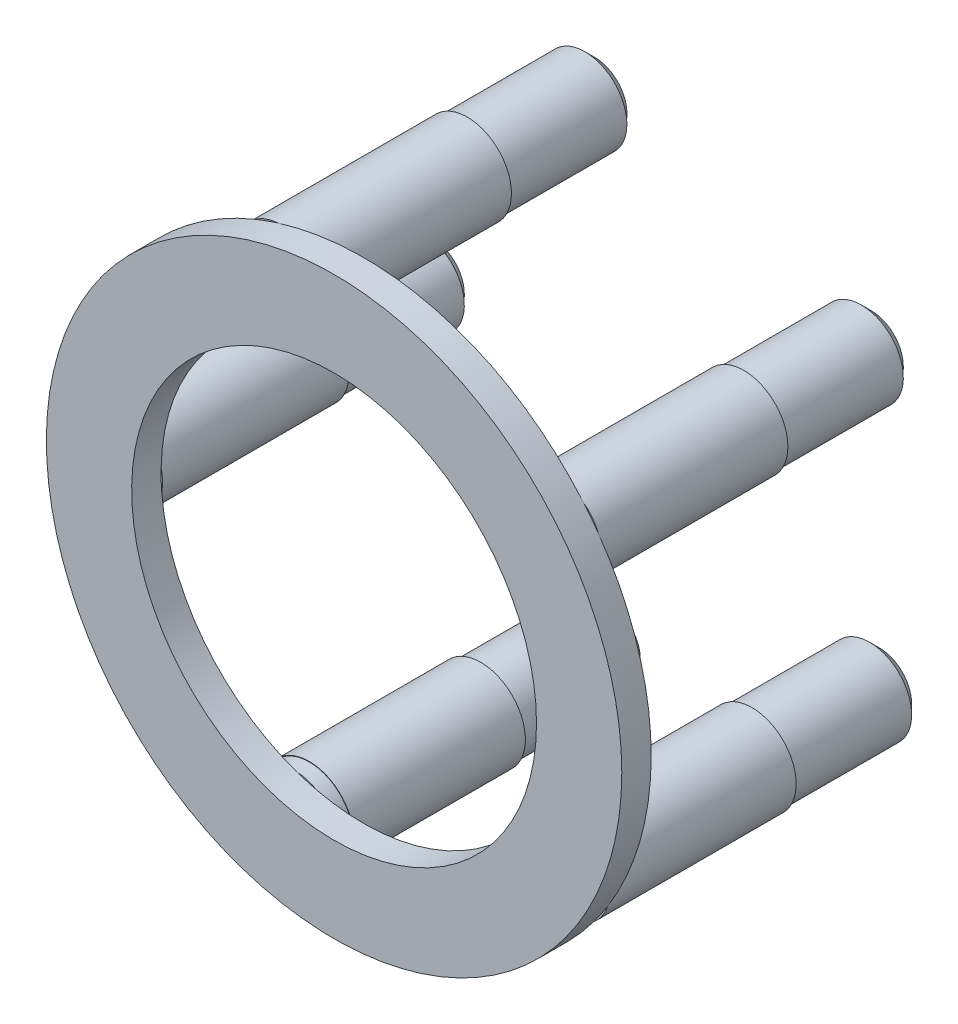
ISO-10303-21;
HEADER;
FILE_DESCRIPTION(('STEP AP214'),'2;1');
FILE_NAME('part.step','',(''),(''),'','','');
FILE_SCHEMA(('AUTOMOTIVE_DESIGN { 1 0 10303 214 1 1 1 1 }'));
ENDSEC;
DATA;
#1=APPLICATION_CONTEXT('core data for automotive mechanical design processes');
#2=APPLICATION_PROTOCOL_DEFINITION('international standard','automotive_design',2000,#1);
#3=PRODUCT_CONTEXT('',#1,'mechanical');
#4=PRODUCT('Part','Part','',(#3));
#5=PRODUCT_RELATED_PRODUCT_CATEGORY('part','',(#4));
#6=PRODUCT_DEFINITION_FORMATION('','',#4);
#7=PRODUCT_DEFINITION_CONTEXT('part definition',#1,'design');
#8=PRODUCT_DEFINITION('design','',#6,#7);
#9=PRODUCT_DEFINITION_SHAPE('','',#8);
#10=(LENGTH_UNIT() NAMED_UNIT(*) SI_UNIT(.MILLI.,.METRE.));
#11=(NAMED_UNIT(*) PLANE_ANGLE_UNIT() SI_UNIT($,.RADIAN.));
#12=(NAMED_UNIT(*) SI_UNIT($,.STERADIAN.) SOLID_ANGLE_UNIT());
#13=UNCERTAINTY_MEASURE_WITH_UNIT(LENGTH_MEASURE(1.E-05),#10,'distance_accuracy_value','');
#14=(GEOMETRIC_REPRESENTATION_CONTEXT(3) GLOBAL_UNCERTAINTY_ASSIGNED_CONTEXT((#13)) GLOBAL_UNIT_ASSIGNED_CONTEXT((#10,
#11,#12)) REPRESENTATION_CONTEXT('',''));
#15=CARTESIAN_POINT('',(0.,0.,0.));
#16=DIRECTION('',(0.,0.,1.));
#17=DIRECTION('',(1.,0.,0.));
#18=AXIS2_PLACEMENT_3D('',#15,#16,#17);
#19=CARTESIAN_POINT('',(20.1421615834205,-37.1244080791547,-6.01363198067618));
#20=DIRECTION('',(0.,0.,1.));
#21=DIRECTION('',(1.,0.,0.));
#22=AXIS2_PLACEMENT_3D('',#19,#20,#21);
#23=PLANE('',#22);
#24=CARTESIAN_POINT('',(39.9356979527047,-21.8529995652863,-6.01363198067618));
#25=DIRECTION('',(0.,0.,-1.));
#26=DIRECTION('',(-1.,0.,0.));
#27=AXIS2_PLACEMENT_3D('',#24,#25,#26);
#28=CIRCLE('',#27,4.5);
#29=CARTESIAN_POINT('',(35.8311516776716,-23.6976404181658,-6.01363198067618));
#30=VERTEX_POINT('',#29);
#31=CARTESIAN_POINT('',(42.5963362648425,-18.2238118087787,-6.01363198067618));
#32=VERTEX_POINT('',#31);
#33=EDGE_CURVE('E145',#30,#32,#28,.T.);
#34=ORIENTED_EDGE('',*,*,#33,.F.);
#35=CARTESIAN_POINT('',(20.1421615834205,-37.1244080791547,-6.01363198067618));
#36=DIRECTION('',(0.,0.,1.));
#37=DIRECTION('',(1.,0.,0.));
#38=AXIS2_PLACEMENT_3D('',#35,#36,#37);
#39=CIRCLE('',#38,20.6499999999925);
#40=CARTESIAN_POINT('',(14.1923892038894,-17.3501139417788,-6.01363198067618));
#41=VERTEX_POINT('',#40);
#42=EDGE_CURVE('E134',#30,#41,#39,.T.);
#43=ORIENTED_EDGE('',*,*,#42,.T.);
#44=CARTESIAN_POINT('',(11.7347281201779,-13.5805115757978,-6.01363198067618));
#45=DIRECTION('',(0.,0.,-1.));
#46=DIRECTION('',(-1.,0.,0.));
#47=AXIS2_PLACEMENT_3D('',#44,#45,#46);
#48=CIRCLE('',#47,4.5);
#49=CARTESIAN_POINT('',(11.4561788739959,-9.08914092560071,-6.01363198067618));
#50=VERTEX_POINT('',#49);
#51=EDGE_CURVE('E224',#50,#41,#48,.T.);
#52=ORIENTED_EDGE('',*,*,#51,.F.);
#53=CARTESIAN_POINT('',(20.1421615834205,-37.1244080791547,-6.01363198067618));
#54=DIRECTION('',(0.,0.,1.));
#55=DIRECTION('',(1.,0.,0.));
#56=AXIS2_PLACEMENT_3D('',#53,#54,#55);
#57=CIRCLE('',#56,29.3499999999926);
#58=EDGE_CURVE('E71',#32,#50,#57,.T.);
#59=ORIENTED_EDGE('',*,*,#58,.F.);
#60=EDGE_LOOP('',(#34,#43,#52,#59));
#61=FACE_BOUND('',#60,.T.);
#62=ADVANCED_FACE('F53',(#61),#23,.F.);
#63=CARTESIAN_POINT('',(40.7826732804343,-51.2300550648684,-6.01363198067618));
#64=DIRECTION('',(0.,0.,-1.));
#65=DIRECTION('',(-1.,0.,0.));
#66=AXIS2_PLACEMENT_3D('',#63,#64,#65);
#67=CIRCLE('',#66,4.5);
#68=CARTESIAN_POINT('',(43.6479857850963,-54.6999231100003,-6.01363198067618));
#69=VERTEX_POINT('',#68);
#70=CARTESIAN_POINT('',(36.5786670195808,-49.6249596288569,-6.01363198067618));
#71=VERTEX_POINT('',#70);
#72=EDGE_CURVE('E174',#69,#71,#67,.T.);
#73=ORIENTED_EDGE('',*,*,#72,.F.);
#74=CARTESIAN_POINT('',(13.0858444188183,-65.6135443958651,-6.01363198067618));
#75=VERTEX_POINT('',#74);
#76=EDGE_CURVE('E326',#75,#69,#57,.T.);
#77=ORIENTED_EDGE('',*,*,#76,.F.);
#78=CARTESIAN_POINT('',(13.1051629880769,-61.1135858635138,-6.01363198067618));
#79=DIRECTION('',(0.,0.,-1.));
#80=DIRECTION('',(-1.,0.,0.));
#81=AXIS2_PLACEMENT_3D('',#78,#79,#80);
#82=CIRCLE('',#81,4.5);
#83=CARTESIAN_POINT('',(15.3415579896269,-57.2086482971701,-6.01363198067618));
#84=VERTEX_POINT('',#83);
#85=EDGE_CURVE('E190',#84,#75,#82,.T.);
#86=ORIENTED_EDGE('',*,*,#85,.F.);
#87=EDGE_CURVE('E381',#84,#71,#39,.T.);
#88=ORIENTED_EDGE('',*,*,#87,.T.);
#89=EDGE_LOOP('',(#73,#77,#86,#88));
#90=FACE_BOUND('',#89,.T.);
#91=ADVANCED_FACE('F277',(#90),#23,.F.);
#92=CARTESIAN_POINT('',(10.6905526311843,-64.9109081864654,-6.01363198067618));
#93=VERTEX_POINT('',#92);
#94=CARTESIAN_POINT('',(13.3325900827298,-56.6193365472633,-6.01363198067618));
#95=VERTEX_POINT('',#94);
#96=EDGE_CURVE('E184',#93,#95,#82,.T.);
#97=ORIENTED_EDGE('',*,*,#96,.F.);
#98=CARTESIAN_POINT('',(-9.13313907577066,-39.2170789356275,-6.01363198067618));
#99=VERTEX_POINT('',#98);
#100=EDGE_CURVE('E311',#99,#93,#57,.T.);
#101=ORIENTED_EDGE('',*,*,#100,.F.);
#102=CARTESIAN_POINT('',(-4.84745442430447,-37.8448883263508,-6.01363198067618));
#103=DIRECTION('',(0.,0.,-1.));
#104=DIRECTION('',(-1.,0.,0.));
#105=AXIS2_PLACEMENT_3D('',#102,#103,#104);
#106=CIRCLE('',#105,4.5);
#107=CARTESIAN_POINT('',(-0.442554044497611,-38.7651342956315,-6.01363198067618));
#108=VERTEX_POINT('',#107);
#109=EDGE_CURVE('E341',#108,#99,#106,.T.);
#110=ORIENTED_EDGE('',*,*,#109,.F.);
#111=EDGE_CURVE('E313',#108,#95,#39,.T.);
#112=ORIENTED_EDGE('',*,*,#111,.T.);
#113=EDGE_LOOP('',(#97,#101,#110,#112));
#114=FACE_BOUND('',#113,.T.);
#115=ADVANCED_FACE('F282',(#114),#23,.F.);
#116=CARTESIAN_POINT('',(44.1211688258314,-20.2001736306495,-6.01363198067618));
#117=VERTEX_POINT('',#116);
#118=CARTESIAN_POINT('',(37.1100520999763,-25.3552453469181,-6.01363198067618));
#119=VERTEX_POINT('',#118);
#120=EDGE_CURVE('E79',#117,#119,#28,.T.);
#121=ORIENTED_EDGE('',*,*,#120,.F.);
#122=CARTESIAN_POINT('',(45.0564183994682,-52.6389917765534,-6.01363198067618));
#123=VERTEX_POINT('',#122);
#124=EDGE_CURVE('E397',#123,#117,#57,.T.);
#125=ORIENTED_EDGE('',*,*,#124,.F.);
#126=CARTESIAN_POINT('',(37.7599410238692,-47.896424955645,-6.01363198067618));
#127=VERTEX_POINT('',#126);
#128=EDGE_CURVE('E180',#127,#123,#67,.T.);
#129=ORIENTED_EDGE('',*,*,#128,.F.);
#130=EDGE_CURVE('E159',#127,#119,#39,.T.);
#131=ORIENTED_EDGE('',*,*,#130,.T.);
#132=EDGE_LOOP('',(#121,#125,#129,#131));
#133=FACE_BOUND('',#132,.T.);
#134=ADVANCED_FACE('F290',(#133),#23,.F.);
#135=CARTESIAN_POINT('',(11.7347281201779,-13.5805115757978,-6.01363198067618));
#136=DIRECTION('',(0.,0.,-1.));
#137=DIRECTION('',(-1.,0.,0.));
#138=AXIS2_PLACEMENT_3D('',#135,#136,#137);
#139=PLANE('',#138);
#140=CARTESIAN_POINT('',(12.2207112703518,-18.0541924291608,-6.01363198067618));
#141=VERTEX_POINT('',#140);
#142=EDGE_CURVE('E406',#41,#141,#48,.T.);
#143=ORIENTED_EDGE('',*,*,#142,.F.);
#144=EDGE_CURVE('E139',#41,#141,#39,.T.);
#145=ORIENTED_EDGE('',*,*,#144,.T.);
#146=EDGE_LOOP('',(#143,#145));
#147=FACE_BOUND('',#146,.T.);
#148=ADVANCED_FACE('F298',(#147),#139,.F.);
#149=CARTESIAN_POINT('',(11.7347281201779,-13.5805115757978,-59.7415540420351));
#150=DIRECTION('',(0.,0.,1.));
#151=DIRECTION('',(1.,0.,0.));
#152=AXIS2_PLACEMENT_3D('',#149,#150,#151);
#153=CYLINDRICAL_SURFACE('',#152,4.5);
#154=CARTESIAN_POINT('',(11.7347281201775,-13.5805115757804,-25.0136319806762));
#155=DIRECTION('',(0.,0.,1.));
#156=DIRECTION('',(1.,0.,0.));
#157=AXIS2_PLACEMENT_3D('',#154,#155,#156);
#158=CIRCLE('',#157,4.49999999999627);
#159=CARTESIAN_POINT('',(16.2347281201738,-13.5805115757804,-25.0136319806762));
#160=VERTEX_POINT('',#159);
#161=EDGE_CURVE('E526',#160,#160,#158,.F.);
#162=ORIENTED_EDGE('',*,*,#161,.F.);
#163=EDGE_LOOP('',(#162));
#164=FACE_BOUND('',#163,.T.);
#165=CARTESIAN_POINT('',(9.10534790982675,-9.92861347899748,-6.01363198067618));
#166=VERTEX_POINT('',#165);
#167=EDGE_CURVE('E219',#166,#50,#48,.T.);
#168=ORIENTED_EDGE('',*,*,#167,.T.);
#169=ORIENTED_EDGE('',*,*,#51,.T.);
#170=ORIENTED_EDGE('',*,*,#142,.T.);
#171=EDGE_CURVE('E213',#141,#166,#48,.T.);
#172=ORIENTED_EDGE('',*,*,#171,.T.);
#173=EDGE_LOOP('',(#168,#169,#170,#172));
#174=FACE_BOUND('',#173,.T.);
#175=ADVANCED_FACE('F302',(#164,#174),#153,.T.);
#176=EDGE_CURVE('E214',#50,#166,#57,.T.);
#177=ORIENTED_EDGE('',*,*,#176,.F.);
#178=ORIENTED_EDGE('',*,*,#167,.F.);
#179=EDGE_LOOP('',(#177,#178));
#180=FACE_BOUND('',#179,.T.);
#181=ADVANCED_FACE('F295',(#180),#139,.F.);
#182=CARTESIAN_POINT('',(20.1421615834205,-37.1244080791547,-3.01363198067618));
#183=DIRECTION('',(0.,0.,1.));
#184=DIRECTION('',(1.,0.,0.));
#185=AXIS2_PLACEMENT_3D('',#182,#183,#184);
#186=PLANE('',#185);
#187=CARTESIAN_POINT('',(20.1421615834205,-37.1244080791547,-3.01363198067618));
#188=DIRECTION('',(0.,0.,1.));
#189=DIRECTION('',(1.,0.,0.));
#190=AXIS2_PLACEMENT_3D('',#187,#188,#189);
#191=CIRCLE('',#190,29.3499999999926);
#192=CARTESIAN_POINT('',(49.4921615834131,-37.1244080791547,-3.01363198067618));
#193=VERTEX_POINT('',#192);
#194=EDGE_CURVE('E209',#193,#193,#191,.T.);
#195=ORIENTED_EDGE('',*,*,#194,.T.);
#196=EDGE_LOOP('',(#195));
#197=FACE_BOUND('',#196,.T.);
#198=CARTESIAN_POINT('',(20.1421615834205,-37.1244080791547,-3.01363198067618));
#199=DIRECTION('',(0.,0.,1.));
#200=DIRECTION('',(1.,0.,0.));
#201=AXIS2_PLACEMENT_3D('',#198,#199,#200);
#202=CIRCLE('',#201,20.6499999999925);
#203=CARTESIAN_POINT('',(40.792161583413,-37.1244080791547,-3.01363198067618));
#204=VERTEX_POINT('',#203);
#205=EDGE_CURVE('E203',#204,#204,#202,.T.);
#206=ORIENTED_EDGE('',*,*,#205,.F.);
#207=EDGE_LOOP('',(#206));
#208=FACE_BOUND('',#207,.T.);
#209=ADVANCED_FACE('F288',(#197,#208),#186,.T.);
#210=CARTESIAN_POINT('',(-9.20507819910118,-36.7218945430525,-6.01363198067618));
#211=VERTEX_POINT('',#210);
#212=CARTESIAN_POINT('',(-0.502890489006508,-36.6723849310003,-6.01363198067618));
#213=VERTEX_POINT('',#212);
#214=EDGE_CURVE('E195',#211,#213,#106,.T.);
#215=ORIENTED_EDGE('',*,*,#214,.F.);
#216=EDGE_CURVE('E218',#166,#211,#57,.T.);
#217=ORIENTED_EDGE('',*,*,#216,.F.);
#218=ORIENTED_EDGE('',*,*,#171,.F.);
#219=EDGE_CURVE('E208',#141,#213,#39,.T.);
#220=ORIENTED_EDGE('',*,*,#219,.T.);
#221=EDGE_LOOP('',(#215,#217,#218,#220));
#222=FACE_BOUND('',#221,.T.);
#223=ADVANCED_FACE('F279',(#222),#23,.F.);
#224=CARTESIAN_POINT('',(20.1421615834205,-37.1244080791547,-3.01363198067618));
#225=DIRECTION('',(0.,0.,-1.));
#226=DIRECTION('',(-1.,0.,0.));
#227=AXIS2_PLACEMENT_3D('',#224,#225,#226);
#228=CYLINDRICAL_SURFACE('',#227,29.3499999999926);
#229=ORIENTED_EDGE('',*,*,#194,.F.);
#230=EDGE_LOOP('',(#229));
#231=FACE_BOUND('',#230,.T.);
#232=ORIENTED_EDGE('',*,*,#176,.T.);
#233=ORIENTED_EDGE('',*,*,#216,.T.);
#234=CARTESIAN_POINT('',(20.1421615834205,-37.1244080791547,-6.01363198067618));
#235=DIRECTION('',(0.,0.,-1.));
#236=DIRECTION('',(-1.,0.,0.));
#237=AXIS2_PLACEMENT_3D('',#234,#235,#236);
#238=CIRCLE('',#237,29.3499999999926);
#239=EDGE_CURVE('E142',#99,#211,#238,.T.);
#240=ORIENTED_EDGE('',*,*,#239,.F.);
#241=ORIENTED_EDGE('',*,*,#100,.T.);
#242=CARTESIAN_POINT('',(20.1421615834205,-37.1244080791547,-6.01363198067618));
#243=DIRECTION('',(0.,0.,-1.));
#244=DIRECTION('',(-1.,0.,0.));
#245=AXIS2_PLACEMENT_3D('',#242,#243,#244);
#246=CIRCLE('',#245,29.3499999999926);
#247=EDGE_CURVE('E189',#75,#93,#246,.T.);
#248=ORIENTED_EDGE('',*,*,#247,.F.);
#249=ORIENTED_EDGE('',*,*,#76,.T.);
#250=CARTESIAN_POINT('',(20.1421615834205,-37.1244080791547,-6.01363198067618));
#251=DIRECTION('',(0.,0.,-1.));
#252=DIRECTION('',(-1.,0.,0.));
#253=AXIS2_PLACEMENT_3D('',#250,#251,#252);
#254=CIRCLE('',#253,29.3499999999926);
#255=EDGE_CURVE('E179',#123,#69,#254,.T.);
#256=ORIENTED_EDGE('',*,*,#255,.F.);
#257=ORIENTED_EDGE('',*,*,#124,.T.);
#258=CARTESIAN_POINT('',(20.1421615834205,-37.1244080791547,-6.01363198067618));
#259=DIRECTION('',(0.,0.,-1.));
#260=DIRECTION('',(-1.,0.,0.));
#261=AXIS2_PLACEMENT_3D('',#258,#259,#260);
#262=CIRCLE('',#261,29.3499999999926);
#263=EDGE_CURVE('E168',#32,#117,#262,.T.);
#264=ORIENTED_EDGE('',*,*,#263,.F.);
#265=ORIENTED_EDGE('',*,*,#58,.T.);
#266=EDGE_LOOP('',(#232,#233,#240,#241,#248,#249,#256,#257,#264,#265));
#267=FACE_BOUND('',#266,.T.);
#268=ADVANCED_FACE('F287',(#231,#267),#228,.T.);
#269=CARTESIAN_POINT('',(20.1421615834205,-37.1244080791547,-3.01363198067618));
#270=DIRECTION('',(0.,0.,-1.));
#271=DIRECTION('',(-1.,0.,0.));
#272=AXIS2_PLACEMENT_3D('',#269,#270,#271);
#273=CYLINDRICAL_SURFACE('',#272,20.6499999999925);
#274=ORIENTED_EDGE('',*,*,#205,.T.);
#275=EDGE_LOOP('',(#274));
#276=FACE_BOUND('',#275,.T.);
#277=ORIENTED_EDGE('',*,*,#144,.F.);
#278=ORIENTED_EDGE('',*,*,#42,.F.);
#279=EDGE_CURVE('E137',#119,#30,#39,.T.);
#280=ORIENTED_EDGE('',*,*,#279,.F.);
#281=ORIENTED_EDGE('',*,*,#130,.F.);
#282=EDGE_CURVE('E385',#71,#127,#39,.T.);
#283=ORIENTED_EDGE('',*,*,#282,.F.);
#284=ORIENTED_EDGE('',*,*,#87,.F.);
#285=EDGE_CURVE('E377',#95,#84,#39,.T.);
#286=ORIENTED_EDGE('',*,*,#285,.F.);
#287=ORIENTED_EDGE('',*,*,#111,.F.);
#288=EDGE_CURVE('E370',#213,#108,#39,.T.);
#289=ORIENTED_EDGE('',*,*,#288,.F.);
#290=ORIENTED_EDGE('',*,*,#219,.F.);
#291=EDGE_LOOP('',(#277,#278,#280,#281,#283,#284,#286,#287,#289,#290));
#292=FACE_BOUND('',#291,.T.);
#293=ADVANCED_FACE('F135',(#276,#292),#273,.F.);
#294=CARTESIAN_POINT('',(-4.84745442430447,-37.8448883263508,-6.01363198067618));
#295=DIRECTION('',(0.,0.,-1.));
#296=DIRECTION('',(-1.,0.,0.));
#297=AXIS2_PLACEMENT_3D('',#294,#295,#296);
#298=PLANE('',#297);
#299=ORIENTED_EDGE('',*,*,#288,.T.);
#300=EDGE_CURVE('E199',#213,#108,#106,.T.);
#301=ORIENTED_EDGE('',*,*,#300,.F.);
#302=EDGE_LOOP('',(#299,#301));
#303=FACE_BOUND('',#302,.T.);
#304=ADVANCED_FACE('F354',(#303),#298,.F.);
#305=CARTESIAN_POINT('',(-4.84745442430447,-37.8448883263508,-59.7415540420351));
#306=DIRECTION('',(0.,0.,1.));
#307=DIRECTION('',(1.,0.,0.));
#308=AXIS2_PLACEMENT_3D('',#305,#306,#307);
#309=CYLINDRICAL_SURFACE('',#308,4.5);
#310=CARTESIAN_POINT('',(-4.84745442431096,-37.8448883263423,-25.0136319806762));
#311=DIRECTION('',(0.,0.,1.));
#312=DIRECTION('',(1.,0.,0.));
#313=AXIS2_PLACEMENT_3D('',#310,#311,#312);
#314=CIRCLE('',#313,4.49999999999359);
#315=CARTESIAN_POINT('',(-0.347454424317369,-37.8448883263423,-25.0136319806762));
#316=VERTEX_POINT('',#315);
#317=EDGE_CURVE('E536',#316,#316,#314,.F.);
#318=ORIENTED_EDGE('',*,*,#317,.F.);
#319=EDGE_LOOP('',(#318));
#320=FACE_BOUND('',#319,.T.);
#321=ORIENTED_EDGE('',*,*,#214,.T.);
#322=ORIENTED_EDGE('',*,*,#300,.T.);
#323=ORIENTED_EDGE('',*,*,#109,.T.);
#324=EDGE_CURVE('E194',#99,#211,#106,.T.);
#325=ORIENTED_EDGE('',*,*,#324,.T.);
#326=EDGE_LOOP('',(#321,#322,#323,#325));
#327=FACE_BOUND('',#326,.T.);
#328=ADVANCED_FACE('F348',(#320,#327),#309,.T.);
#329=ORIENTED_EDGE('',*,*,#324,.F.);
#330=ORIENTED_EDGE('',*,*,#239,.T.);
#331=EDGE_LOOP('',(#329,#330));
#332=FACE_BOUND('',#331,.T.);
#333=ADVANCED_FACE('F350',(#332),#298,.F.);
#334=CARTESIAN_POINT('',(13.1051629880769,-61.1135858635138,-6.01363198067618));
#335=DIRECTION('',(0.,0.,-1.));
#336=DIRECTION('',(-1.,0.,0.));
#337=AXIS2_PLACEMENT_3D('',#334,#335,#336);
#338=PLANE('',#337);
#339=ORIENTED_EDGE('',*,*,#285,.T.);
#340=EDGE_CURVE('E185',#95,#84,#82,.T.);
#341=ORIENTED_EDGE('',*,*,#340,.F.);
#342=EDGE_LOOP('',(#339,#341));
#343=FACE_BOUND('',#342,.T.);
#344=ADVANCED_FACE('F352',(#343),#338,.F.);
#345=CARTESIAN_POINT('',(13.1051629880769,-61.1135858635138,-59.7415540420351));
#346=DIRECTION('',(0.,0.,1.));
#347=DIRECTION('',(1.,0.,0.));
#348=AXIS2_PLACEMENT_3D('',#345,#346,#347);
#349=CYLINDRICAL_SURFACE('',#348,4.5);
#350=CARTESIAN_POINT('',(13.1051629880769,-61.1135858635138,-7.51363198067618));
#351=DIRECTION('',(0.,0.,1.));
#352=DIRECTION('',(1.,0.,0.));
#353=AXIS2_PLACEMENT_3D('',#350,#351,#352);
#354=CIRCLE('',#353,4.5);
#355=CARTESIAN_POINT('',(17.6051629880769,-61.1135858635138,-7.51363198067618));
#356=VERTEX_POINT('',#355);
#357=EDGE_CURVE('E58',#356,#356,#354,.T.);
#358=ORIENTED_EDGE('',*,*,#357,.T.);
#359=EDGE_LOOP('',(#358));
#360=FACE_BOUND('',#359,.T.);
#361=ORIENTED_EDGE('',*,*,#340,.T.);
#362=ORIENTED_EDGE('',*,*,#85,.T.);
#363=EDGE_CURVE('E318',#75,#93,#82,.T.);
#364=ORIENTED_EDGE('',*,*,#363,.T.);
#365=ORIENTED_EDGE('',*,*,#96,.T.);
#366=EDGE_LOOP('',(#361,#362,#364,#365));
#367=FACE_BOUND('',#366,.T.);
#368=ADVANCED_FACE('F330',(#360,#367),#349,.T.);
#369=ORIENTED_EDGE('',*,*,#363,.F.);
#370=ORIENTED_EDGE('',*,*,#247,.T.);
#371=EDGE_LOOP('',(#369,#370));
#372=FACE_BOUND('',#371,.T.);
#373=ADVANCED_FACE('F328',(#372),#338,.F.);
#374=CARTESIAN_POINT('',(40.7826732804343,-51.2300550648684,-6.01363198067618));
#375=DIRECTION('',(0.,0.,-1.));
#376=DIRECTION('',(-1.,0.,0.));
#377=AXIS2_PLACEMENT_3D('',#374,#375,#376);
#378=PLANE('',#377);
#379=ORIENTED_EDGE('',*,*,#282,.T.);
#380=EDGE_CURVE('E175',#71,#127,#67,.T.);
#381=ORIENTED_EDGE('',*,*,#380,.F.);
#382=EDGE_LOOP('',(#379,#381));
#383=FACE_BOUND('',#382,.T.);
#384=ADVANCED_FACE('F422',(#383),#378,.F.);
#385=CARTESIAN_POINT('',(40.7826732804343,-51.2300550648684,-59.7415540420351));
#386=DIRECTION('',(0.,0.,1.));
#387=DIRECTION('',(1.,0.,0.));
#388=AXIS2_PLACEMENT_3D('',#385,#386,#387);
#389=CYLINDRICAL_SURFACE('',#388,4.5);
#390=CARTESIAN_POINT('',(40.7826732804443,-51.2300550648649,-25.0136319806762));
#391=DIRECTION('',(0.,0.,1.));
#392=DIRECTION('',(1.,0.,0.));
#393=AXIS2_PLACEMENT_3D('',#390,#391,#392);
#394=CIRCLE('',#393,4.50000000000664);
#395=CARTESIAN_POINT('',(45.282673280451,-51.2300550648649,-25.0136319806762));
#396=VERTEX_POINT('',#395);
#397=EDGE_CURVE('E337',#396,#396,#394,.F.);
#398=ORIENTED_EDGE('',*,*,#397,.F.);
#399=EDGE_LOOP('',(#398));
#400=FACE_BOUND('',#399,.T.);
#401=ORIENTED_EDGE('',*,*,#380,.T.);
#402=ORIENTED_EDGE('',*,*,#128,.T.);
#403=EDGE_CURVE('E413',#123,#69,#67,.T.);
#404=ORIENTED_EDGE('',*,*,#403,.T.);
#405=ORIENTED_EDGE('',*,*,#72,.T.);
#406=EDGE_LOOP('',(#401,#402,#404,#405));
#407=FACE_BOUND('',#406,.T.);
#408=ADVANCED_FACE('F421',(#400,#407),#389,.T.);
#409=ORIENTED_EDGE('',*,*,#403,.F.);
#410=ORIENTED_EDGE('',*,*,#255,.T.);
#411=EDGE_LOOP('',(#409,#410));
#412=FACE_BOUND('',#411,.T.);
#413=ADVANCED_FACE('F425',(#412),#378,.F.);
#414=CARTESIAN_POINT('',(39.9356979527047,-21.8529995652863,-6.01363198067618));
#415=DIRECTION('',(0.,0.,-1.));
#416=DIRECTION('',(-1.,0.,0.));
#417=AXIS2_PLACEMENT_3D('',#414,#415,#416);
#418=PLANE('',#417);
#419=ORIENTED_EDGE('',*,*,#279,.T.);
#420=EDGE_CURVE('E151',#119,#30,#28,.T.);
#421=ORIENTED_EDGE('',*,*,#420,.F.);
#422=EDGE_LOOP('',(#419,#421));
#423=FACE_BOUND('',#422,.T.);
#424=ADVANCED_FACE('F157',(#423),#418,.F.);
#425=CARTESIAN_POINT('',(39.9356979527047,-21.8529995652863,-59.7415540420351));
#426=DIRECTION('',(0.,0.,1.));
#427=DIRECTION('',(1.,0.,0.));
#428=AXIS2_PLACEMENT_3D('',#425,#426,#427);
#429=CYLINDRICAL_SURFACE('',#428,4.5);
#430=CARTESIAN_POINT('',(39.9356979527145,-21.852999565272,-25.0136319806762));
#431=DIRECTION('',(0.,0.,1.));
#432=DIRECTION('',(1.,0.,0.));
#433=AXIS2_PLACEMENT_3D('',#430,#431,#432);
#434=CIRCLE('',#433,4.50000000000434);
#435=CARTESIAN_POINT('',(44.4356979527189,-21.852999565272,-25.0136319806762));
#436=VERTEX_POINT('',#435);
#437=EDGE_CURVE('E338',#436,#436,#434,.F.);
#438=ORIENTED_EDGE('',*,*,#437,.F.);
#439=EDGE_LOOP('',(#438));
#440=FACE_BOUND('',#439,.T.);
#441=EDGE_CURVE('E154',#32,#117,#28,.T.);
#442=ORIENTED_EDGE('',*,*,#441,.T.);
#443=ORIENTED_EDGE('',*,*,#120,.T.);
#444=ORIENTED_EDGE('',*,*,#420,.T.);
#445=ORIENTED_EDGE('',*,*,#33,.T.);
#446=EDGE_LOOP('',(#442,#443,#444,#445));
#447=FACE_BOUND('',#446,.T.);
#448=ADVANCED_FACE('F160',(#440,#447),#429,.T.);
#449=ORIENTED_EDGE('',*,*,#441,.F.);
#450=ORIENTED_EDGE('',*,*,#263,.T.);
#451=EDGE_LOOP('',(#449,#450));
#452=FACE_BOUND('',#451,.T.);
#453=ADVANCED_FACE('F437',(#452),#418,.F.);
#454=CARTESIAN_POINT('',(11.7347281201775,-13.5805115757804,6.71429008070047));
#455=DIRECTION('',(0.,0.,-1.));
#456=DIRECTION('',(0.,1.,0.));
#457=AXIS2_PLACEMENT_3D('',#454,#455,#456);
#458=CYLINDRICAL_SURFACE('',#457,4.275);
#459=CARTESIAN_POINT('',(11.7347281201775,-13.5805115757804,-37.0136319806773));
#460=DIRECTION('',(0.,0.,-1.));
#461=DIRECTION('',(-1.,0.,0.));
#462=AXIS2_PLACEMENT_3D('',#459,#460,#461);
#463=CIRCLE('',#462,4.275);
#464=CARTESIAN_POINT('',(7.45972812017753,-13.5805115757804,-37.0136319806773));
#465=VERTEX_POINT('',#464);
#466=EDGE_CURVE('E251',#465,#465,#463,.F.);
#467=ORIENTED_EDGE('',*,*,#466,.T.);
#468=EDGE_LOOP('',(#467));
#469=FACE_BOUND('',#468,.T.);
#470=CARTESIAN_POINT('',(11.7347281201775,-13.5805115757804,-25.0136319806762));
#471=DIRECTION('',(0.,0.,1.));
#472=DIRECTION('',(1.,0.,0.));
#473=AXIS2_PLACEMENT_3D('',#470,#471,#472);
#474=CIRCLE('',#473,4.275);
#475=CARTESIAN_POINT('',(16.0097281201775,-13.5805115757804,-25.0136319806762));
#476=VERTEX_POINT('',#475);
#477=EDGE_CURVE('E532',#476,#476,#474,.F.);
#478=ORIENTED_EDGE('',*,*,#477,.T.);
#479=EDGE_LOOP('',(#478));
#480=FACE_BOUND('',#479,.T.);
#481=ADVANCED_FACE('F443',(#469,#480),#458,.T.);
#482=CARTESIAN_POINT('',(20.1421615834205,-37.1244080791547,-25.0136319806762));
#483=DIRECTION('',(0.,0.,1.));
#484=DIRECTION('',(1.,0.,0.));
#485=AXIS2_PLACEMENT_3D('',#482,#483,#484);
#486=PLANE('',#485);
#487=ORIENTED_EDGE('',*,*,#161,.T.);
#488=EDGE_LOOP('',(#487));
#489=FACE_BOUND('',#488,.T.);
#490=ORIENTED_EDGE('',*,*,#477,.F.);
#491=EDGE_LOOP('',(#490));
#492=FACE_BOUND('',#491,.T.);
#493=ADVANCED_FACE('F447',(#489,#492),#486,.F.);
#494=CARTESIAN_POINT('',(-4.84745442431096,-37.8448883263423,6.71429008070047));
#495=DIRECTION('',(0.,0.,-1.));
#496=DIRECTION('',(0.,1.,0.));
#497=AXIS2_PLACEMENT_3D('',#494,#495,#496);
#498=CYLINDRICAL_SURFACE('',#497,4.275);
#499=CARTESIAN_POINT('',(-4.84745442431096,-37.8448883263423,-37.0136319806773));
#500=DIRECTION('',(0.,0.,-1.));
#501=DIRECTION('',(-1.,0.,0.));
#502=AXIS2_PLACEMENT_3D('',#499,#500,#501);
#503=CIRCLE('',#502,4.275);
#504=CARTESIAN_POINT('',(-9.12245442431096,-37.8448883263423,-37.0136319806773));
#505=VERTEX_POINT('',#504);
#506=EDGE_CURVE('E244',#505,#505,#503,.F.);
#507=ORIENTED_EDGE('',*,*,#506,.T.);
#508=EDGE_LOOP('',(#507));
#509=FACE_BOUND('',#508,.T.);
#510=CARTESIAN_POINT('',(-4.84745442431096,-37.8448883263423,-25.0136319806762));
#511=DIRECTION('',(0.,0.,1.));
#512=DIRECTION('',(1.,0.,0.));
#513=AXIS2_PLACEMENT_3D('',#510,#511,#512);
#514=CIRCLE('',#513,4.275);
#515=CARTESIAN_POINT('',(-0.572454424310961,-37.8448883263423,-25.0136319806762));
#516=VERTEX_POINT('',#515);
#517=EDGE_CURVE('E169',#516,#516,#514,.F.);
#518=ORIENTED_EDGE('',*,*,#517,.T.);
#519=EDGE_LOOP('',(#518));
#520=FACE_BOUND('',#519,.T.);
#521=ADVANCED_FACE('F452',(#509,#520),#498,.T.);
#522=CARTESIAN_POINT('',(20.1421615834205,-37.1244080791547,-25.0136319806762));
#523=DIRECTION('',(0.,0.,1.));
#524=DIRECTION('',(1.,0.,0.));
#525=AXIS2_PLACEMENT_3D('',#522,#523,#524);
#526=PLANE('',#525);
#527=ORIENTED_EDGE('',*,*,#317,.T.);
#528=EDGE_LOOP('',(#527));
#529=FACE_BOUND('',#528,.T.);
#530=ORIENTED_EDGE('',*,*,#517,.F.);
#531=EDGE_LOOP('',(#530));
#532=FACE_BOUND('',#531,.T.);
#533=ADVANCED_FACE('F458',(#529,#532),#526,.F.);
#534=CARTESIAN_POINT('',(40.7826732804443,-51.2300550648649,6.71429008070047));
#535=DIRECTION('',(0.,0.,-1.));
#536=DIRECTION('',(0.,1.,0.));
#537=AXIS2_PLACEMENT_3D('',#534,#535,#536);
#538=CYLINDRICAL_SURFACE('',#537,4.275);
#539=CARTESIAN_POINT('',(40.7826732804443,-51.2300550648649,-37.0136319806773));
#540=DIRECTION('',(0.,0.,-1.));
#541=DIRECTION('',(-1.,0.,0.));
#542=AXIS2_PLACEMENT_3D('',#539,#540,#541);
#543=CIRCLE('',#542,4.275);
#544=CARTESIAN_POINT('',(36.5076732804443,-51.2300550648649,-37.0136319806773));
#545=VERTEX_POINT('',#544);
#546=EDGE_CURVE('E228',#545,#545,#543,.F.);
#547=ORIENTED_EDGE('',*,*,#546,.T.);
#548=EDGE_LOOP('',(#547));
#549=FACE_BOUND('',#548,.T.);
#550=CARTESIAN_POINT('',(40.7826732804443,-51.2300550648649,-25.0136319806762));
#551=DIRECTION('',(0.,0.,1.));
#552=DIRECTION('',(1.,0.,0.));
#553=AXIS2_PLACEMENT_3D('',#550,#551,#552);
#554=CIRCLE('',#553,4.275);
#555=CARTESIAN_POINT('',(45.0576732804443,-51.2300550648649,-25.0136319806762));
#556=VERTEX_POINT('',#555);
#557=EDGE_CURVE('E335',#556,#556,#554,.F.);
#558=ORIENTED_EDGE('',*,*,#557,.T.);
#559=EDGE_LOOP('',(#558));
#560=FACE_BOUND('',#559,.T.);
#561=ADVANCED_FACE('F461',(#549,#560),#538,.T.);
#562=CARTESIAN_POINT('',(20.1421615834205,-37.1244080791547,-25.0136319806762));
#563=DIRECTION('',(0.,0.,1.));
#564=DIRECTION('',(1.,0.,0.));
#565=AXIS2_PLACEMENT_3D('',#562,#563,#564);
#566=PLANE('',#565);
#567=ORIENTED_EDGE('',*,*,#397,.T.);
#568=EDGE_LOOP('',(#567));
#569=FACE_BOUND('',#568,.T.);
#570=ORIENTED_EDGE('',*,*,#557,.F.);
#571=EDGE_LOOP('',(#570));
#572=FACE_BOUND('',#571,.T.);
#573=ADVANCED_FACE('F507',(#569,#572),#566,.F.);
#574=CARTESIAN_POINT('',(39.9356979527145,-21.852999565272,6.71429008070047));
#575=DIRECTION('',(0.,0.,-1.));
#576=DIRECTION('',(0.,1.,0.));
#577=AXIS2_PLACEMENT_3D('',#574,#575,#576);
#578=CYLINDRICAL_SURFACE('',#577,4.275);
#579=CARTESIAN_POINT('',(39.9356979527145,-21.852999565272,-37.0136319806773));
#580=DIRECTION('',(0.,0.,-1.));
#581=DIRECTION('',(-1.,0.,0.));
#582=AXIS2_PLACEMENT_3D('',#579,#580,#581);
#583=CIRCLE('',#582,4.275);
#584=CARTESIAN_POINT('',(35.6606979527145,-21.852999565272,-37.0136319806773));
#585=VERTEX_POINT('',#584);
#586=EDGE_CURVE('E14',#585,#585,#583,.F.);
#587=ORIENTED_EDGE('',*,*,#586,.T.);
#588=EDGE_LOOP('',(#587));
#589=FACE_BOUND('',#588,.T.);
#590=CARTESIAN_POINT('',(39.9356979527145,-21.852999565272,-25.0136319806762));
#591=DIRECTION('',(0.,0.,1.));
#592=DIRECTION('',(1.,0.,0.));
#593=AXIS2_PLACEMENT_3D('',#590,#591,#592);
#594=CIRCLE('',#593,4.275);
#595=CARTESIAN_POINT('',(44.2106979527145,-21.852999565272,-25.0136319806762));
#596=VERTEX_POINT('',#595);
#597=EDGE_CURVE('E523',#596,#596,#594,.F.);
#598=ORIENTED_EDGE('',*,*,#597,.T.);
#599=EDGE_LOOP('',(#598));
#600=FACE_BOUND('',#599,.T.);
#601=ADVANCED_FACE('F510',(#589,#600),#578,.T.);
#602=CARTESIAN_POINT('',(20.1421615834205,-37.1244080791547,-25.0136319806762));
#603=DIRECTION('',(0.,0.,1.));
#604=DIRECTION('',(1.,0.,0.));
#605=AXIS2_PLACEMENT_3D('',#602,#603,#604);
#606=PLANE('',#605);
#607=ORIENTED_EDGE('',*,*,#437,.T.);
#608=EDGE_LOOP('',(#607));
#609=FACE_BOUND('',#608,.T.);
#610=ORIENTED_EDGE('',*,*,#597,.F.);
#611=EDGE_LOOP('',(#610));
#612=FACE_BOUND('',#611,.T.);
#613=ADVANCED_FACE('F474',(#609,#612),#606,.F.);
#614=CARTESIAN_POINT('',(11.7347281201779,-13.5805115757977,-38.0136319806773));
#615=DIRECTION('',(0.,0.,-1.));
#616=DIRECTION('',(0.,1.,0.));
#617=AXIS2_PLACEMENT_3D('',#614,#615,#616);
#618=PLANE('',#617);
#619=CARTESIAN_POINT('',(11.7347281201775,-13.5805115757804,-38.0136319806773));
#620=DIRECTION('',(0.,0.,-1.));
#621=DIRECTION('',(0.,1.,0.));
#622=AXIS2_PLACEMENT_3D('',#619,#620,#621);
#623=CIRCLE('',#622,3.27500000000001);
#624=CARTESIAN_POINT('',(11.7347281201775,-10.3055115757804,-38.0136319806773));
#625=VERTEX_POINT('',#624);
#626=EDGE_CURVE('E248',#625,#625,#623,.T.);
#627=ORIENTED_EDGE('',*,*,#626,.T.);
#628=EDGE_LOOP('',(#627));
#629=FACE_BOUND('',#628,.T.);
#630=ADVANCED_FACE('F470',(#629),#618,.T.);
#631=CARTESIAN_POINT('',(-4.84745442430447,-37.8448883263508,-38.0136319806773));
#632=DIRECTION('',(0.,0.,-1.));
#633=DIRECTION('',(0.,1.,0.));
#634=AXIS2_PLACEMENT_3D('',#631,#632,#633);
#635=PLANE('',#634);
#636=CARTESIAN_POINT('',(-4.84745442431096,-37.8448883263423,-38.0136319806773));
#637=DIRECTION('',(0.,0.,-1.));
#638=DIRECTION('',(0.,1.,0.));
#639=AXIS2_PLACEMENT_3D('',#636,#637,#638);
#640=CIRCLE('',#639,3.27500000000001);
#641=CARTESIAN_POINT('',(-4.84745442431096,-34.5698883263423,-38.0136319806773));
#642=VERTEX_POINT('',#641);
#643=EDGE_CURVE('E240',#642,#642,#640,.T.);
#644=ORIENTED_EDGE('',*,*,#643,.T.);
#645=EDGE_LOOP('',(#644));
#646=FACE_BOUND('',#645,.T.);
#647=ADVANCED_FACE('F466',(#646),#635,.T.);
#648=CARTESIAN_POINT('',(40.7826732804343,-51.2300550648684,-38.0136319806773));
#649=DIRECTION('',(0.,0.,-1.));
#650=DIRECTION('',(0.,1.,0.));
#651=AXIS2_PLACEMENT_3D('',#648,#649,#650);
#652=PLANE('',#651);
#653=CARTESIAN_POINT('',(40.7826732804443,-51.2300550648649,-38.0136319806773));
#654=DIRECTION('',(0.,0.,-1.));
#655=DIRECTION('',(0.,1.,0.));
#656=AXIS2_PLACEMENT_3D('',#653,#654,#655);
#657=CIRCLE('',#656,3.27500000000002);
#658=CARTESIAN_POINT('',(40.7826732804443,-47.9550550648649,-38.0136319806773));
#659=VERTEX_POINT('',#658);
#660=EDGE_CURVE('E223',#659,#659,#657,.T.);
#661=ORIENTED_EDGE('',*,*,#660,.T.);
#662=EDGE_LOOP('',(#661));
#663=FACE_BOUND('',#662,.T.);
#664=ADVANCED_FACE('F469',(#663),#652,.T.);
#665=CARTESIAN_POINT('',(39.9356979527047,-21.8529995652862,-38.0136319806773));
#666=DIRECTION('',(0.,0.,-1.));
#667=DIRECTION('',(0.,1.,0.));
#668=AXIS2_PLACEMENT_3D('',#665,#666,#667);
#669=PLANE('',#668);
#670=CARTESIAN_POINT('',(39.9356979527145,-21.852999565272,-38.0136319806773));
#671=DIRECTION('',(0.,0.,-1.));
#672=DIRECTION('',(0.,1.,0.));
#673=AXIS2_PLACEMENT_3D('',#670,#671,#672);
#674=CIRCLE('',#673,3.27500000000002);
#675=CARTESIAN_POINT('',(39.9356979527145,-18.577999565272,-38.0136319806773));
#676=VERTEX_POINT('',#675);
#677=EDGE_CURVE('E64',#676,#676,#674,.T.);
#678=ORIENTED_EDGE('',*,*,#677,.T.);
#679=EDGE_LOOP('',(#678));
#680=FACE_BOUND('',#679,.T.);
#681=ADVANCED_FACE('F261',(#680),#669,.T.);
#682=CARTESIAN_POINT('',(40.7826732804443,-51.2300550648649,-38.0136319806773));
#683=DIRECTION('',(0.,0.,1.));
#684=DIRECTION('',(1.,0.,0.));
#685=AXIS2_PLACEMENT_3D('',#682,#683,#684);
#686=CONICAL_SURFACE('',#685,3.27500000000002,0.785398163397437);
#687=ORIENTED_EDGE('',*,*,#546,.F.);
#688=EDGE_LOOP('',(#687));
#689=FACE_BOUND('',#688,.T.);
#690=ORIENTED_EDGE('',*,*,#660,.F.);
#691=EDGE_LOOP('',(#690));
#692=FACE_BOUND('',#691,.T.);
#693=ADVANCED_FACE('F478',(#689,#692),#686,.T.);
#694=CARTESIAN_POINT('',(-4.84745442431096,-37.8448883263423,-38.0136319806773));
#695=DIRECTION('',(0.,0.,1.));
#696=DIRECTION('',(1.,0.,0.));
#697=AXIS2_PLACEMENT_3D('',#694,#695,#696);
#698=CONICAL_SURFACE('',#697,3.27500000000001,0.785398163397442);
#699=ORIENTED_EDGE('',*,*,#506,.F.);
#700=EDGE_LOOP('',(#699));
#701=FACE_BOUND('',#700,.T.);
#702=ORIENTED_EDGE('',*,*,#643,.F.);
#703=EDGE_LOOP('',(#702));
#704=FACE_BOUND('',#703,.T.);
#705=ADVANCED_FACE('F273',(#701,#704),#698,.T.);
#706=CARTESIAN_POINT('',(11.7347281201775,-13.5805115757804,-38.0136319806773));
#707=DIRECTION('',(0.,0.,1.));
#708=DIRECTION('',(1.,0.,0.));
#709=AXIS2_PLACEMENT_3D('',#706,#707,#708);
#710=CONICAL_SURFACE('',#709,3.27500000000001,0.785398163397449);
#711=ORIENTED_EDGE('',*,*,#466,.F.);
#712=EDGE_LOOP('',(#711));
#713=FACE_BOUND('',#712,.T.);
#714=ORIENTED_EDGE('',*,*,#626,.F.);
#715=EDGE_LOOP('',(#714));
#716=FACE_BOUND('',#715,.T.);
#717=ADVANCED_FACE('F265',(#713,#716),#710,.T.);
#718=CARTESIAN_POINT('',(39.9356979527145,-21.852999565272,-38.0136319806773));
#719=DIRECTION('',(0.,0.,1.));
#720=DIRECTION('',(1.,0.,0.));
#721=AXIS2_PLACEMENT_3D('',#718,#719,#720);
#722=CONICAL_SURFACE('',#721,3.27500000000003,0.785398163397447);
#723=ORIENTED_EDGE('',*,*,#586,.F.);
#724=EDGE_LOOP('',(#723));
#725=FACE_BOUND('',#724,.T.);
#726=ORIENTED_EDGE('',*,*,#677,.F.);
#727=EDGE_LOOP('',(#726));
#728=FACE_BOUND('',#727,.T.);
#729=ADVANCED_FACE('F56',(#725,#728),#722,.T.);
#730=CARTESIAN_POINT('',(20.1421615834205,-37.1244080791547,-7.51363198067618));
#731=DIRECTION('',(0.,0.,1.));
#732=DIRECTION('',(1.,0.,0.));
#733=AXIS2_PLACEMENT_3D('',#730,#731,#732);
#734=PLANE('',#733);
#735=ORIENTED_EDGE('',*,*,#357,.F.);
#736=EDGE_LOOP('',(#735));
#737=FACE_BOUND('',#736,.T.);
#738=CARTESIAN_POINT('',(13.1051629880769,-61.1135858635138,-7.51363198067618));
#739=DIRECTION('',(0.,0.,1.));
#740=DIRECTION('',(1.,0.,0.));
#741=AXIS2_PLACEMENT_3D('',#738,#739,#740);
#742=CIRCLE('',#741,4.55);
#743=CARTESIAN_POINT('',(17.6551629880769,-61.1135858635138,-7.51363198067618));
#744=VERTEX_POINT('',#743);
#745=EDGE_CURVE('E545',#744,#744,#742,.F.);
#746=ORIENTED_EDGE('',*,*,#745,.F.);
#747=EDGE_LOOP('',(#746));
#748=FACE_BOUND('',#747,.T.);
#749=ADVANCED_FACE('F264',(#737,#748),#734,.T.);
#750=CARTESIAN_POINT('',(13.1051629880769,-61.1135858635138,6.85571143691899));
#751=DIRECTION('',(0.,0.,-1.));
#752=DIRECTION('',(-1.,0.,0.));
#753=AXIS2_PLACEMENT_3D('',#750,#751,#752);
#754=CYLINDRICAL_SURFACE('',#753,4.55);
#755=CARTESIAN_POINT('',(13.1051629880769,-61.1135858635138,-25.0136319806762));
#756=DIRECTION('',(0.,0.,-1.));
#757=DIRECTION('',(-1.,0.,0.));
#758=AXIS2_PLACEMENT_3D('',#755,#756,#757);
#759=CIRCLE('',#758,4.55);
#760=CARTESIAN_POINT('',(8.55516298807694,-61.1135858635138,-25.0136319806762));
#761=VERTEX_POINT('',#760);
#762=EDGE_CURVE('E549',#761,#761,#759,.T.);
#763=ORIENTED_EDGE('',*,*,#762,.F.);
#764=EDGE_LOOP('',(#763));
#765=FACE_BOUND('',#764,.T.);
#766=ORIENTED_EDGE('',*,*,#745,.T.);
#767=EDGE_LOOP('',(#766));
#768=FACE_BOUND('',#767,.T.);
#769=ADVANCED_FACE('F270',(#765,#768),#754,.T.);
#770=CARTESIAN_POINT('',(13.1051629880769,-61.1135858635138,-38.0136319806773));
#771=DIRECTION('',(0.,0.,-1.));
#772=DIRECTION('',(0.,1.,0.));
#773=AXIS2_PLACEMENT_3D('',#770,#771,#772);
#774=PLANE('',#773);
#775=CARTESIAN_POINT('',(13.1051629880769,-61.1135858635138,-38.0136319806773));
#776=DIRECTION('',(0.,0.,-1.));
#777=DIRECTION('',(0.,1.,0.));
#778=AXIS2_PLACEMENT_3D('',#775,#776,#777);
#779=CIRCLE('',#778,3.27499999999998);
#780=CARTESIAN_POINT('',(13.1051629880769,-57.8385858635138,-38.0136319806773));
#781=VERTEX_POINT('',#780);
#782=EDGE_CURVE('E232',#781,#781,#779,.T.);
#783=ORIENTED_EDGE('',*,*,#782,.T.);
#784=EDGE_LOOP('',(#783));
#785=FACE_BOUND('',#784,.T.);
#786=ADVANCED_FACE('F482',(#785),#774,.T.);
#787=CARTESIAN_POINT('',(13.1051629880769,-61.1135858635138,-38.0136319806773));
#788=DIRECTION('',(0.,0.,1.));
#789=DIRECTION('',(1.,0.,0.));
#790=AXIS2_PLACEMENT_3D('',#787,#788,#789);
#791=CONICAL_SURFACE('',#790,3.27499999999998,0.785398163397452);
#792=CARTESIAN_POINT('',(13.1051629880769,-61.1135858635138,-37.0136319806772));
#793=DIRECTION('',(0.,0.,-1.));
#794=DIRECTION('',(-1.,0.,0.));
#795=AXIS2_PLACEMENT_3D('',#792,#793,#794);
#796=CIRCLE('',#795,4.275);
#797=CARTESIAN_POINT('',(8.83016298807694,-61.1135858635138,-37.0136319806772));
#798=VERTEX_POINT('',#797);
#799=EDGE_CURVE('E236',#798,#798,#796,.F.);
#800=ORIENTED_EDGE('',*,*,#799,.F.);
#801=EDGE_LOOP('',(#800));
#802=FACE_BOUND('',#801,.T.);
#803=ORIENTED_EDGE('',*,*,#782,.F.);
#804=EDGE_LOOP('',(#803));
#805=FACE_BOUND('',#804,.T.);
#806=ADVANCED_FACE('F484',(#802,#805),#791,.T.);
#807=CARTESIAN_POINT('',(13.1051629880769,-61.1135858635138,6.71429008070047));
#808=DIRECTION('',(0.,0.,-1.));
#809=DIRECTION('',(0.,1.,0.));
#810=AXIS2_PLACEMENT_3D('',#807,#808,#809);
#811=CYLINDRICAL_SURFACE('',#810,4.275);
#812=ORIENTED_EDGE('',*,*,#799,.T.);
#813=EDGE_LOOP('',(#812));
#814=FACE_BOUND('',#813,.T.);
#815=CARTESIAN_POINT('',(13.1051629880769,-61.1135858635138,-25.0136319806762));
#816=DIRECTION('',(0.,0.,1.));
#817=DIRECTION('',(1.,0.,0.));
#818=AXIS2_PLACEMENT_3D('',#815,#816,#817);
#819=CIRCLE('',#818,4.275);
#820=CARTESIAN_POINT('',(17.3801629880769,-61.1135858635138,-25.0136319806762));
#821=VERTEX_POINT('',#820);
#822=EDGE_CURVE('E152',#821,#821,#819,.F.);
#823=ORIENTED_EDGE('',*,*,#822,.T.);
#824=EDGE_LOOP('',(#823));
#825=FACE_BOUND('',#824,.T.);
#826=ADVANCED_FACE('F489',(#814,#825),#811,.T.);
#827=CARTESIAN_POINT('',(20.1421615834205,-37.1244080791547,-25.0136319806762));
#828=DIRECTION('',(0.,0.,1.));
#829=DIRECTION('',(1.,0.,0.));
#830=AXIS2_PLACEMENT_3D('',#827,#828,#829);
#831=PLANE('',#830);
#832=ORIENTED_EDGE('',*,*,#822,.F.);
#833=EDGE_LOOP('',(#832));
#834=FACE_BOUND('',#833,.T.);
#835=ORIENTED_EDGE('',*,*,#762,.T.);
#836=EDGE_LOOP('',(#835));
#837=FACE_BOUND('',#836,.T.);
#838=ADVANCED_FACE('F502',(#834,#837),#831,.F.);
#839=CLOSED_SHELL('',(#62,#91,#115,#134,#148,#175,#181,#209,#223,#268,#293,#304,#328,#333,#344,
#368,#373,#384,#408,#413,#424,#448,#453,#481,#493,#521,#533,#561,#573,#601,#613,#630,#647,#664,
#681,#693,#705,#717,#729,#749,#769,#786,#806,#826,#838));
#840=MANIFOLD_SOLID_BREP('B2',#839);
#841=ADVANCED_BREP_SHAPE_REPRESENTATION('',(#18,#840),#14);
#842=SHAPE_DEFINITION_REPRESENTATION(#9,#841);
ENDSEC;
END-ISO-10303-21;
